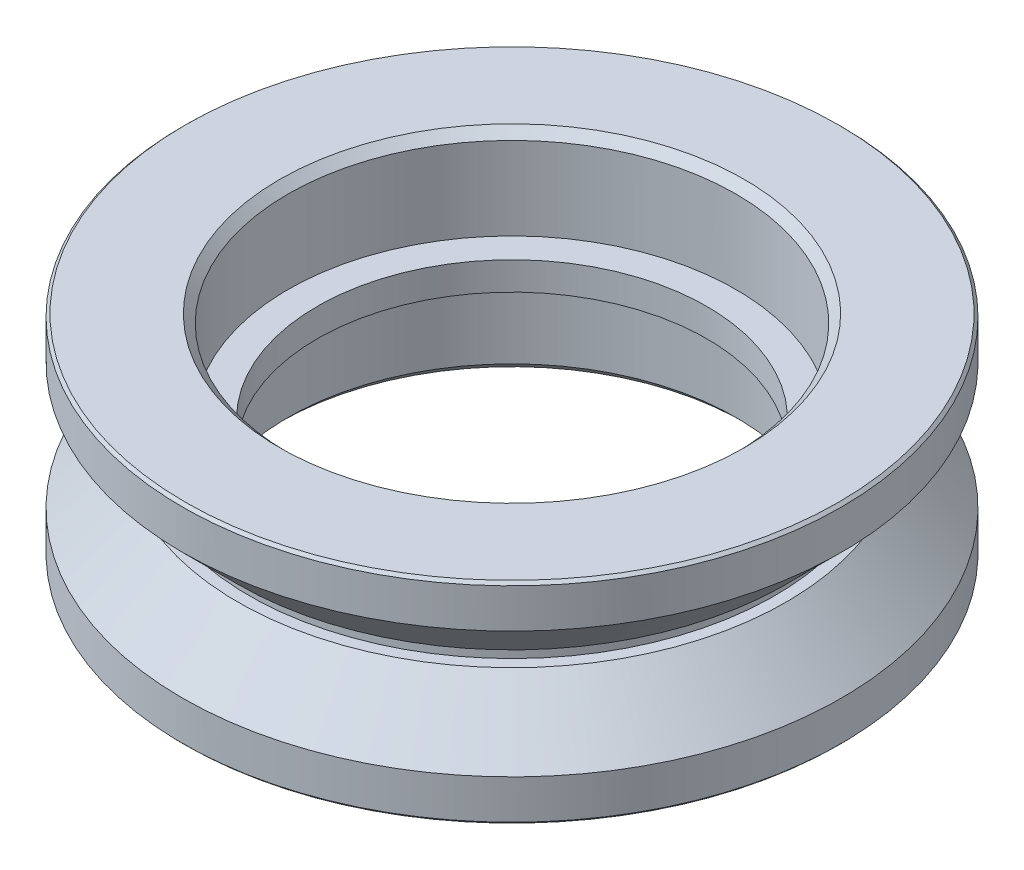
ISO-10303-21;
HEADER;
FILE_DESCRIPTION(('STEP AP214'),'2;1');
FILE_NAME('part.step','',(''),(''),'','','');
FILE_SCHEMA(('AUTOMOTIVE_DESIGN { 1 0 10303 214 1 1 1 1 }'));
ENDSEC;
DATA;
#1=APPLICATION_CONTEXT('core data for automotive mechanical design processes');
#2=APPLICATION_PROTOCOL_DEFINITION('international standard','automotive_design',2000,#1);
#3=PRODUCT_CONTEXT('',#1,'mechanical');
#4=PRODUCT('Part','Part','',(#3));
#5=PRODUCT_RELATED_PRODUCT_CATEGORY('part','',(#4));
#6=PRODUCT_DEFINITION_FORMATION('','',#4);
#7=PRODUCT_DEFINITION_CONTEXT('part definition',#1,'design');
#8=PRODUCT_DEFINITION('design','',#6,#7);
#9=PRODUCT_DEFINITION_SHAPE('','',#8);
#10=(LENGTH_UNIT() NAMED_UNIT(*) SI_UNIT(.MILLI.,.METRE.));
#11=(NAMED_UNIT(*) PLANE_ANGLE_UNIT() SI_UNIT($,.RADIAN.));
#12=(NAMED_UNIT(*) SI_UNIT($,.STERADIAN.) SOLID_ANGLE_UNIT());
#13=UNCERTAINTY_MEASURE_WITH_UNIT(LENGTH_MEASURE(1.E-05),#10,'distance_accuracy_value','');
#14=(GEOMETRIC_REPRESENTATION_CONTEXT(3) GLOBAL_UNCERTAINTY_ASSIGNED_CONTEXT((#13)) GLOBAL_UNIT_ASSIGNED_CONTEXT((#10,
#11,#12)) REPRESENTATION_CONTEXT('',''));
#15=CARTESIAN_POINT('',(0.,0.,0.));
#16=DIRECTION('',(0.,0.,1.));
#17=DIRECTION('',(1.,0.,0.));
#18=AXIS2_PLACEMENT_3D('',#15,#16,#17);
#19=CARTESIAN_POINT('',(0.,-3.65000000000199,0.));
#20=DIRECTION('',(0.,1.,0.));
#21=DIRECTION('',(-1.,0.,0.));
#22=AXIS2_PLACEMENT_3D('',#19,#20,#21);
#23=CONICAL_SURFACE('',#22,11.750000000002,0.785398163397297);
#24=CARTESIAN_POINT('',(0.,-3.75000000000201,0.));
#25=DIRECTION('',(0.,1.,0.));
#26=DIRECTION('',(-1.,0.,0.));
#27=AXIS2_PLACEMENT_3D('',#24,#25,#26);
#28=CIRCLE('',#27,11.650000000002);
#29=CARTESIAN_POINT('',(-11.650000000002,-3.75000000000201,0.));
#30=VERTEX_POINT('',#29);
#31=EDGE_CURVE('E18',#30,#30,#28,.T.);
#32=ORIENTED_EDGE('',*,*,#31,.T.);
#33=EDGE_LOOP('',(#32));
#34=FACE_BOUND('',#33,.T.);
#35=CARTESIAN_POINT('',(0.,-3.65,0.));
#36=DIRECTION('',(0.,-1.,0.));
#37=DIRECTION('',(0.,0.,-1.));
#38=AXIS2_PLACEMENT_3D('',#35,#36,#37);
#39=CIRCLE('',#38,11.75);
#40=CARTESIAN_POINT('',(0.,-3.65,-11.75));
#41=VERTEX_POINT('',#40);
#42=EDGE_CURVE('E35',#41,#41,#39,.F.);
#43=ORIENTED_EDGE('',*,*,#42,.F.);
#44=EDGE_LOOP('',(#43));
#45=FACE_BOUND('',#44,.T.);
#46=ADVANCED_FACE('F15',(#34,#45),#23,.T.);
#47=CARTESIAN_POINT('',(0.,4.125,0.));
#48=DIRECTION('',(0.,-1.,0.));
#49=DIRECTION('',(0.,0.,-1.));
#50=AXIS2_PLACEMENT_3D('',#47,#48,#49);
#51=CYLINDRICAL_SURFACE('',#50,11.75);
#52=CARTESIAN_POINT('',(0.,-2.25000000000015,0.));
#53=DIRECTION('',(0.,-1.,0.));
#54=DIRECTION('',(0.,0.,1.));
#55=AXIS2_PLACEMENT_3D('',#52,#53,#54);
#56=CIRCLE('',#55,11.7499999999999);
#57=CARTESIAN_POINT('',(0.,-2.25000000000015,11.7499999999999));
#58=VERTEX_POINT('',#57);
#59=EDGE_CURVE('E74',#58,#58,#56,.F.);
#60=ORIENTED_EDGE('',*,*,#59,.F.);
#61=EDGE_LOOP('',(#60));
#62=FACE_BOUND('',#61,.T.);
#63=ORIENTED_EDGE('',*,*,#42,.T.);
#64=EDGE_LOOP('',(#63));
#65=FACE_BOUND('',#64,.T.);
#66=ADVANCED_FACE('F161',(#62,#65),#51,.T.);
#67=CARTESIAN_POINT('',(0.,-3.75,0.));
#68=DIRECTION('',(0.,1.,0.));
#69=DIRECTION('',(0.,0.,1.));
#70=AXIS2_PLACEMENT_3D('',#67,#68,#69);
#71=PLANE('',#70);
#72=CARTESIAN_POINT('',(0.,-3.75000000000002,0.));
#73=DIRECTION('',(0.,-1.,0.));
#74=DIRECTION('',(1.,0.,0.));
#75=AXIS2_PLACEMENT_3D('',#72,#73,#74);
#76=CIRCLE('',#75,8.28714999999998);
#77=CARTESIAN_POINT('',(8.28714999999998,-3.75000000000002,0.));
#78=VERTEX_POINT('',#77);
#79=EDGE_CURVE('E72',#78,#78,#76,.F.);
#80=ORIENTED_EDGE('',*,*,#79,.T.);
#81=EDGE_LOOP('',(#80));
#82=FACE_BOUND('',#81,.T.);
#83=ORIENTED_EDGE('',*,*,#31,.F.);
#84=EDGE_LOOP('',(#83));
#85=FACE_BOUND('',#84,.T.);
#86=ADVANCED_FACE('F159',(#82,#85),#71,.F.);
#87=CARTESIAN_POINT('',(0.,-2.25000000000015,0.));
#88=DIRECTION('',(0.,-1.,0.));
#89=DIRECTION('',(0.,0.,-1.));
#90=AXIS2_PLACEMENT_3D('',#87,#88,#89);
#91=CONICAL_SURFACE('',#90,11.7499999999999,0.7853981633973);
#92=ORIENTED_EDGE('',*,*,#59,.T.);
#93=EDGE_LOOP('',(#92));
#94=FACE_BOUND('',#93,.T.);
#95=CARTESIAN_POINT('',(0.,-0.274999999999853,0.));
#96=DIRECTION('',(0.,-1.,0.));
#97=DIRECTION('',(0.,0.,-1.));
#98=AXIS2_PLACEMENT_3D('',#95,#96,#97);
#99=CIRCLE('',#98,9.77500000000015);
#100=CARTESIAN_POINT('',(0.,-0.274999999999853,-9.77500000000015));
#101=VERTEX_POINT('',#100);
#102=EDGE_CURVE('E69',#101,#101,#99,.T.);
#103=ORIENTED_EDGE('',*,*,#102,.T.);
#104=EDGE_LOOP('',(#103));
#105=FACE_BOUND('',#104,.T.);
#106=ADVANCED_FACE('F155',(#94,#105),#91,.T.);
#107=CARTESIAN_POINT('',(0.,-3.75000000000002,0.));
#108=DIRECTION('',(0.,-1.,0.));
#109=DIRECTION('',(1.,0.,0.));
#110=AXIS2_PLACEMENT_3D('',#107,#108,#109);
#111=CONICAL_SURFACE('',#110,8.28714999999998,0.7853981633973);
#112=CARTESIAN_POINT('',(0.,-3.449999999925,0.));
#113=DIRECTION('',(0.,1.,0.));
#114=DIRECTION('',(0.,0.,1.));
#115=AXIS2_PLACEMENT_3D('',#112,#113,#114);
#116=CIRCLE('',#115,7.98715);
#117=CARTESIAN_POINT('',(0.,-3.449999999925,7.98715));
#118=VERTEX_POINT('',#117);
#119=EDGE_CURVE('E68',#118,#118,#116,.T.);
#120=ORIENTED_EDGE('',*,*,#119,.T.);
#121=EDGE_LOOP('',(#120));
#122=FACE_BOUND('',#121,.T.);
#123=ORIENTED_EDGE('',*,*,#79,.F.);
#124=EDGE_LOOP('',(#123));
#125=FACE_BOUND('',#124,.T.);
#126=ADVANCED_FACE('F151',(#122,#125),#111,.F.);
#127=CARTESIAN_POINT('',(0.,-0.275,0.));
#128=DIRECTION('',(0.,-1.,0.));
#129=DIRECTION('',(0.,0.,-1.));
#130=AXIS2_PLACEMENT_3D('',#127,#128,#129);
#131=PLANE('',#130);
#132=CARTESIAN_POINT('',(0.,-0.275,0.));
#133=DIRECTION('',(0.,-1.,0.));
#134=DIRECTION('',(0.,0.,-1.));
#135=AXIS2_PLACEMENT_3D('',#132,#133,#134);
#136=CIRCLE('',#135,9.375);
#137=CARTESIAN_POINT('',(0.,-0.275,-9.375));
#138=VERTEX_POINT('',#137);
#139=EDGE_CURVE('E64',#138,#138,#136,.F.);
#140=ORIENTED_EDGE('',*,*,#139,.F.);
#141=EDGE_LOOP('',(#140));
#142=FACE_BOUND('',#141,.T.);
#143=ORIENTED_EDGE('',*,*,#102,.F.);
#144=EDGE_LOOP('',(#143));
#145=FACE_BOUND('',#144,.T.);
#146=ADVANCED_FACE('F147',(#142,#145),#131,.F.);
#147=CARTESIAN_POINT('',(0.,-3.75,0.));
#148=DIRECTION('',(0.,1.,0.));
#149=DIRECTION('',(0.,0.,1.));
#150=AXIS2_PLACEMENT_3D('',#147,#148,#149);
#151=CYLINDRICAL_SURFACE('',#150,7.98715);
#152=ORIENTED_EDGE('',*,*,#119,.F.);
#153=EDGE_LOOP('',(#152));
#154=FACE_BOUND('',#153,.T.);
#155=CARTESIAN_POINT('',(0.,-0.5,0.));
#156=DIRECTION('',(0.,1.,0.));
#157=DIRECTION('',(0.,0.,1.));
#158=AXIS2_PLACEMENT_3D('',#155,#156,#157);
#159=CIRCLE('',#158,7.98715);
#160=CARTESIAN_POINT('',(0.,-0.5,7.98715));
#161=VERTEX_POINT('',#160);
#162=EDGE_CURVE('E60',#161,#161,#159,.T.);
#163=ORIENTED_EDGE('',*,*,#162,.T.);
#164=EDGE_LOOP('',(#163));
#165=FACE_BOUND('',#164,.T.);
#166=ADVANCED_FACE('F143',(#154,#165),#151,.F.);
#167=CARTESIAN_POINT('',(0.,0.3025,0.));
#168=DIRECTION('',(0.,-1.,0.));
#169=DIRECTION('',(0.,0.,-1.));
#170=AXIS2_PLACEMENT_3D('',#167,#168,#169);
#171=CYLINDRICAL_SURFACE('',#170,9.375);
#172=ORIENTED_EDGE('',*,*,#139,.T.);
#173=EDGE_LOOP('',(#172));
#174=FACE_BOUND('',#173,.T.);
#175=CARTESIAN_POINT('',(0.,0.275,0.));
#176=DIRECTION('',(0.,-1.,0.));
#177=DIRECTION('',(0.,0.,-1.));
#178=AXIS2_PLACEMENT_3D('',#175,#176,#177);
#179=CIRCLE('',#178,9.375);
#180=CARTESIAN_POINT('',(0.,0.275,-9.375));
#181=VERTEX_POINT('',#180);
#182=EDGE_CURVE('E56',#181,#181,#179,.F.);
#183=ORIENTED_EDGE('',*,*,#182,.F.);
#184=EDGE_LOOP('',(#183));
#185=FACE_BOUND('',#184,.T.);
#186=ADVANCED_FACE('F139',(#174,#185),#171,.T.);
#187=CARTESIAN_POINT('',(0.,-0.5,0.));
#188=DIRECTION('',(0.,1.,0.));
#189=DIRECTION('',(0.,0.,1.));
#190=AXIS2_PLACEMENT_3D('',#187,#188,#189);
#191=PLANE('',#190);
#192=CARTESIAN_POINT('',(0.,-0.5,0.));
#193=DIRECTION('',(0.,1.,0.));
#194=DIRECTION('',(0.,0.,1.));
#195=AXIS2_PLACEMENT_3D('',#192,#193,#194);
#196=CIRCLE('',#195,6.947169826516);
#197=CARTESIAN_POINT('',(0.,-0.5,6.947169826516));
#198=VERTEX_POINT('',#197);
#199=EDGE_CURVE('E52',#198,#198,#196,.T.);
#200=ORIENTED_EDGE('',*,*,#199,.T.);
#201=EDGE_LOOP('',(#200));
#202=FACE_BOUND('',#201,.T.);
#203=ORIENTED_EDGE('',*,*,#162,.F.);
#204=EDGE_LOOP('',(#203));
#205=FACE_BOUND('',#204,.T.);
#206=ADVANCED_FACE('F135',(#202,#205),#191,.F.);
#207=CARTESIAN_POINT('',(0.,0.275,0.));
#208=DIRECTION('',(0.,-1.,0.));
#209=DIRECTION('',(0.,0.,-1.));
#210=AXIS2_PLACEMENT_3D('',#207,#208,#209);
#211=PLANE('',#210);
#212=ORIENTED_EDGE('',*,*,#182,.T.);
#213=EDGE_LOOP('',(#212));
#214=FACE_BOUND('',#213,.T.);
#215=CARTESIAN_POINT('',(0.,0.274999999999853,0.));
#216=DIRECTION('',(0.,1.,0.));
#217=DIRECTION('',(0.,0.,1.));
#218=AXIS2_PLACEMENT_3D('',#215,#216,#217);
#219=CIRCLE('',#218,9.77500000000015);
#220=CARTESIAN_POINT('',(0.,0.274999999999853,9.77500000000015));
#221=VERTEX_POINT('',#220);
#222=EDGE_CURVE('E48',#221,#221,#219,.T.);
#223=ORIENTED_EDGE('',*,*,#222,.F.);
#224=EDGE_LOOP('',(#223));
#225=FACE_BOUND('',#224,.T.);
#226=ADVANCED_FACE('F131',(#214,#225),#211,.T.);
#227=CARTESIAN_POINT('',(0.,-0.5,0.));
#228=DIRECTION('',(0.,1.,0.));
#229=DIRECTION('',(0.,0.,1.));
#230=AXIS2_PLACEMENT_3D('',#227,#228,#229);
#231=CYLINDRICAL_SURFACE('',#230,6.947169826516);
#232=CARTESIAN_POINT('',(0.,0.5,0.));
#233=DIRECTION('',(0.,1.,0.));
#234=DIRECTION('',(0.,0.,1.));
#235=AXIS2_PLACEMENT_3D('',#232,#233,#234);
#236=CIRCLE('',#235,6.947169826516);
#237=CARTESIAN_POINT('',(0.,0.5,6.947169826516));
#238=VERTEX_POINT('',#237);
#239=EDGE_CURVE('E44',#238,#238,#236,.F.);
#240=ORIENTED_EDGE('',*,*,#239,.F.);
#241=EDGE_LOOP('',(#240));
#242=FACE_BOUND('',#241,.T.);
#243=ORIENTED_EDGE('',*,*,#199,.F.);
#244=EDGE_LOOP('',(#243));
#245=FACE_BOUND('',#244,.T.);
#246=ADVANCED_FACE('F127',(#242,#245),#231,.F.);
#247=CARTESIAN_POINT('',(0.,2.25000000000015,0.));
#248=DIRECTION('',(0.,1.,0.));
#249=DIRECTION('',(0.,0.,1.));
#250=AXIS2_PLACEMENT_3D('',#247,#248,#249);
#251=CONICAL_SURFACE('',#250,11.7499999999999,0.7853981633973);
#252=CARTESIAN_POINT('',(0.,2.25,0.));
#253=DIRECTION('',(0.,-1.,0.));
#254=DIRECTION('',(0.,0.,-1.));
#255=AXIS2_PLACEMENT_3D('',#252,#253,#254);
#256=CIRCLE('',#255,11.75);
#257=CARTESIAN_POINT('',(0.,2.25,-11.75));
#258=VERTEX_POINT('',#257);
#259=EDGE_CURVE('E43',#258,#258,#256,.F.);
#260=ORIENTED_EDGE('',*,*,#259,.F.);
#261=EDGE_LOOP('',(#260));
#262=FACE_BOUND('',#261,.T.);
#263=ORIENTED_EDGE('',*,*,#222,.T.);
#264=EDGE_LOOP('',(#263));
#265=FACE_BOUND('',#264,.T.);
#266=ADVANCED_FACE('F123',(#262,#265),#251,.T.);
#267=CARTESIAN_POINT('',(0.,0.5,0.));
#268=DIRECTION('',(0.,1.,0.));
#269=DIRECTION('',(0.,0.,1.));
#270=AXIS2_PLACEMENT_3D('',#267,#268,#269);
#271=PLANE('',#270);
#272=ORIENTED_EDGE('',*,*,#239,.T.);
#273=EDGE_LOOP('',(#272));
#274=FACE_BOUND('',#273,.T.);
#275=CARTESIAN_POINT('',(0.,0.5,0.));
#276=DIRECTION('',(0.,1.,0.));
#277=DIRECTION('',(0.,0.,1.));
#278=AXIS2_PLACEMENT_3D('',#275,#276,#277);
#279=CIRCLE('',#278,7.98715);
#280=CARTESIAN_POINT('',(0.,0.5,7.98715));
#281=VERTEX_POINT('',#280);
#282=EDGE_CURVE('E38',#281,#281,#279,.T.);
#283=ORIENTED_EDGE('',*,*,#282,.T.);
#284=EDGE_LOOP('',(#283));
#285=FACE_BOUND('',#284,.T.);
#286=ADVANCED_FACE('F119',(#274,#285),#271,.T.);
#287=CARTESIAN_POINT('',(0.,4.125,0.));
#288=DIRECTION('',(0.,-1.,0.));
#289=DIRECTION('',(0.,0.,-1.));
#290=AXIS2_PLACEMENT_3D('',#287,#288,#289);
#291=CYLINDRICAL_SURFACE('',#290,11.75);
#292=ORIENTED_EDGE('',*,*,#259,.T.);
#293=EDGE_LOOP('',(#292));
#294=FACE_BOUND('',#293,.T.);
#295=CARTESIAN_POINT('',(0.,3.65000000000149,0.));
#296=DIRECTION('',(0.,-1.,0.));
#297=DIRECTION('',(0.,0.,-1.));
#298=AXIS2_PLACEMENT_3D('',#295,#296,#297);
#299=CIRCLE('',#298,11.7500000000015);
#300=CARTESIAN_POINT('',(0.,3.65000000000149,-11.7500000000015));
#301=VERTEX_POINT('',#300);
#302=EDGE_CURVE('E42',#301,#301,#299,.F.);
#303=ORIENTED_EDGE('',*,*,#302,.F.);
#304=EDGE_LOOP('',(#303));
#305=FACE_BOUND('',#304,.T.);
#306=ADVANCED_FACE('F116',(#294,#305),#291,.T.);
#307=CARTESIAN_POINT('',(0.,-3.75,0.));
#308=DIRECTION('',(0.,1.,0.));
#309=DIRECTION('',(0.,0.,1.));
#310=AXIS2_PLACEMENT_3D('',#307,#308,#309);
#311=CYLINDRICAL_SURFACE('',#310,7.98715);
#312=CARTESIAN_POINT('',(0.,3.44999999999998,0.));
#313=DIRECTION('',(0.,1.,0.));
#314=DIRECTION('',(0.,0.,-1.));
#315=AXIS2_PLACEMENT_3D('',#312,#313,#314);
#316=CIRCLE('',#315,7.98715000000002);
#317=CARTESIAN_POINT('',(0.,3.44999999999998,-7.98715000000002));
#318=VERTEX_POINT('',#317);
#319=EDGE_CURVE('E32',#318,#318,#316,.T.);
#320=ORIENTED_EDGE('',*,*,#319,.T.);
#321=EDGE_LOOP('',(#320));
#322=FACE_BOUND('',#321,.T.);
#323=ORIENTED_EDGE('',*,*,#282,.F.);
#324=EDGE_LOOP('',(#323));
#325=FACE_BOUND('',#324,.T.);
#326=ADVANCED_FACE('F96',(#322,#325),#311,.F.);
#327=CARTESIAN_POINT('',(0.,3.65000000000149,0.));
#328=DIRECTION('',(0.,-1.,0.));
#329=DIRECTION('',(1.,0.,0.));
#330=AXIS2_PLACEMENT_3D('',#327,#328,#329);
#331=CONICAL_SURFACE('',#330,11.7500000000015,0.785398163397299);
#332=ORIENTED_EDGE('',*,*,#302,.T.);
#333=EDGE_LOOP('',(#332));
#334=FACE_BOUND('',#333,.T.);
#335=CARTESIAN_POINT('',(0.,3.75000000000151,0.));
#336=DIRECTION('',(0.,-1.,0.));
#337=DIRECTION('',(1.,0.,0.));
#338=AXIS2_PLACEMENT_3D('',#335,#336,#337);
#339=CIRCLE('',#338,11.6500000000015);
#340=CARTESIAN_POINT('',(11.6500000000015,3.75000000000151,0.));
#341=VERTEX_POINT('',#340);
#342=EDGE_CURVE('E23',#341,#341,#339,.F.);
#343=ORIENTED_EDGE('',*,*,#342,.F.);
#344=EDGE_LOOP('',(#343));
#345=FACE_BOUND('',#344,.T.);
#346=ADVANCED_FACE('F103',(#334,#345),#331,.T.);
#347=CARTESIAN_POINT('',(0.,3.75000000000002,0.));
#348=DIRECTION('',(0.,1.,0.));
#349=DIRECTION('',(-1.,0.,0.));
#350=AXIS2_PLACEMENT_3D('',#347,#348,#349);
#351=CONICAL_SURFACE('',#350,8.28714999999998,0.7853981633973);
#352=ORIENTED_EDGE('',*,*,#319,.F.);
#353=EDGE_LOOP('',(#352));
#354=FACE_BOUND('',#353,.T.);
#355=CARTESIAN_POINT('',(0.,3.75000000000002,0.));
#356=DIRECTION('',(0.,1.,0.));
#357=DIRECTION('',(-1.,0.,0.));
#358=AXIS2_PLACEMENT_3D('',#355,#356,#357);
#359=CIRCLE('',#358,8.28714999999998);
#360=CARTESIAN_POINT('',(-8.28714999999998,3.75000000000002,0.));
#361=VERTEX_POINT('',#360);
#362=EDGE_CURVE('E10',#361,#361,#359,.F.);
#363=ORIENTED_EDGE('',*,*,#362,.F.);
#364=EDGE_LOOP('',(#363));
#365=FACE_BOUND('',#364,.T.);
#366=ADVANCED_FACE('F99',(#354,#365),#351,.F.);
#367=CARTESIAN_POINT('',(0.,3.75,0.));
#368=DIRECTION('',(0.,1.,0.));
#369=DIRECTION('',(0.,0.,1.));
#370=AXIS2_PLACEMENT_3D('',#367,#368,#369);
#371=PLANE('',#370);
#372=ORIENTED_EDGE('',*,*,#362,.T.);
#373=EDGE_LOOP('',(#372));
#374=FACE_BOUND('',#373,.T.);
#375=ORIENTED_EDGE('',*,*,#342,.T.);
#376=EDGE_LOOP('',(#375));
#377=FACE_BOUND('',#376,.T.);
#378=ADVANCED_FACE('F102',(#374,#377),#371,.T.);
#379=CLOSED_SHELL('',(#46,#66,#86,#106,#126,#146,#166,#186,#206,#226,#246,#266,#286,#306,#326,
#346,#366,#378));
#380=MANIFOLD_SOLID_BREP('B1',#379);
#381=ADVANCED_BREP_SHAPE_REPRESENTATION('',(#18,#380),#14);
#382=SHAPE_DEFINITION_REPRESENTATION(#9,#381);
ENDSEC;
END-ISO-10303-21;
